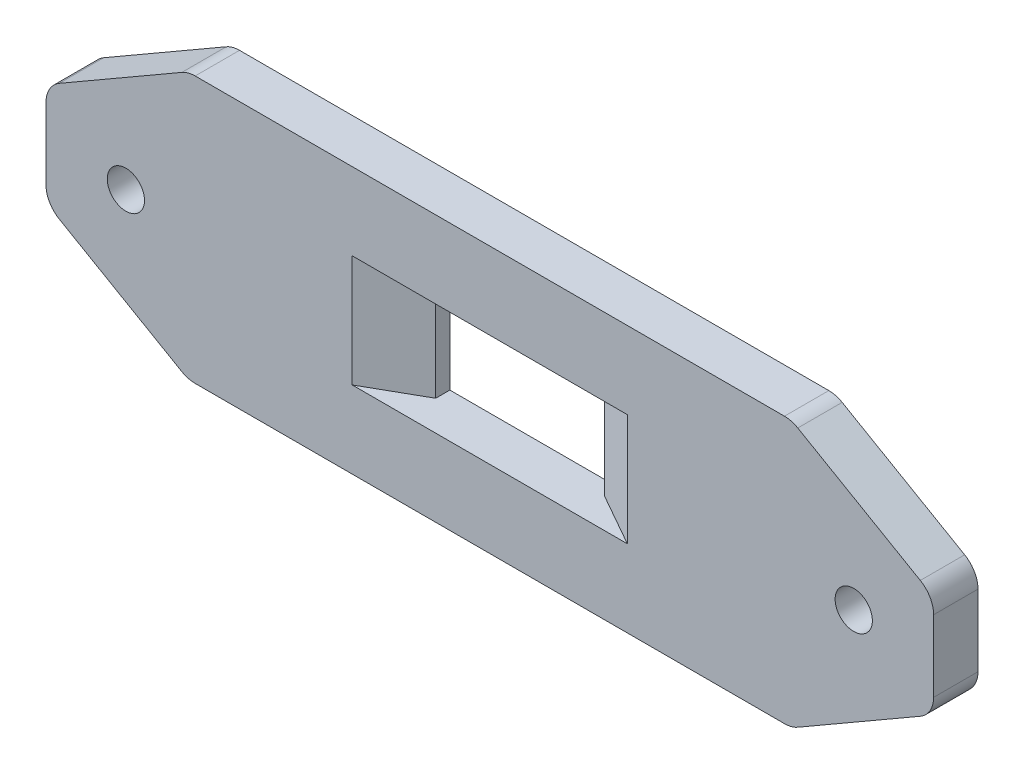
ISO-10303-21;
HEADER;
FILE_DESCRIPTION(('STEP AP214'),'2;1');
FILE_NAME('part.step','',(''),(''),'','','');
FILE_SCHEMA(('AUTOMOTIVE_DESIGN { 1 0 10303 214 1 1 1 1 }'));
ENDSEC;
DATA;
#1=APPLICATION_CONTEXT('core data for automotive mechanical design processes');
#2=APPLICATION_PROTOCOL_DEFINITION('international standard','automotive_design',2000,#1);
#3=PRODUCT_CONTEXT('',#1,'mechanical');
#4=PRODUCT('Part','Part','',(#3));
#5=PRODUCT_RELATED_PRODUCT_CATEGORY('part','',(#4));
#6=PRODUCT_DEFINITION_FORMATION('','',#4);
#7=PRODUCT_DEFINITION_CONTEXT('part definition',#1,'design');
#8=PRODUCT_DEFINITION('design','',#6,#7);
#9=PRODUCT_DEFINITION_SHAPE('','',#8);
#10=(LENGTH_UNIT() NAMED_UNIT(*) SI_UNIT(.MILLI.,.METRE.));
#11=(NAMED_UNIT(*) PLANE_ANGLE_UNIT() SI_UNIT($,.RADIAN.));
#12=(NAMED_UNIT(*) SI_UNIT($,.STERADIAN.) SOLID_ANGLE_UNIT());
#13=UNCERTAINTY_MEASURE_WITH_UNIT(LENGTH_MEASURE(1.E-05),#10,'distance_accuracy_value','');
#14=(GEOMETRIC_REPRESENTATION_CONTEXT(3) GLOBAL_UNCERTAINTY_ASSIGNED_CONTEXT((#13)) GLOBAL_UNIT_ASSIGNED_CONTEXT((#10,
#11,#12)) REPRESENTATION_CONTEXT('',''));
#15=CARTESIAN_POINT('',(0.,0.,0.));
#16=DIRECTION('',(0.,0.,1.));
#17=DIRECTION('',(1.,0.,0.));
#18=AXIS2_PLACEMENT_3D('',#15,#16,#17);
#19=CARTESIAN_POINT('',(0.,0.,5.));
#20=DIRECTION('',(-1.,0.,0.));
#21=DIRECTION('',(0.,0.,1.));
#22=AXIS2_PLACEMENT_3D('',#19,#20,#21);
#23=PLANE('',#22);
#24=DIRECTION('',(0.,1.,0.));
#25=VECTOR('',#24,1.);
#26=CARTESIAN_POINT('',(0.,0.,0.));
#27=LINE('',#26,#25);
#28=CARTESIAN_POINT('',(0.,10.9696551146029,0.));
#29=VERTEX_POINT('',#28);
#30=CARTESIAN_POINT('',(0.,19.0303448853971,0.));
#31=VERTEX_POINT('',#30);
#32=EDGE_CURVE('E228',#29,#31,#27,.T.);
#33=ORIENTED_EDGE('',*,*,#32,.T.);
#34=DIRECTION('',(0.,0.,-1.));
#35=VECTOR('',#34,1.);
#36=CARTESIAN_POINT('',(0.,19.0303448853971,5.));
#37=LINE('',#36,#35);
#38=CARTESIAN_POINT('',(0.,19.0303448853971,5.));
#39=VERTEX_POINT('',#38);
#40=EDGE_CURVE('E343',#31,#39,#37,.F.);
#41=ORIENTED_EDGE('',*,*,#40,.T.);
#42=DIRECTION('',(0.,1.,0.));
#43=VECTOR('',#42,1.);
#44=CARTESIAN_POINT('',(0.,0.,5.));
#45=LINE('',#44,#43);
#46=CARTESIAN_POINT('',(0.,10.9696551146029,5.));
#47=VERTEX_POINT('',#46);
#48=EDGE_CURVE('E231',#47,#39,#45,.T.);
#49=ORIENTED_EDGE('',*,*,#48,.F.);
#50=DIRECTION('',(0.,0.,1.));
#51=VECTOR('',#50,1.);
#52=CARTESIAN_POINT('',(0.,10.9696551146029,0.));
#53=LINE('',#52,#51);
#54=EDGE_CURVE('E340',#47,#29,#53,.F.);
#55=ORIENTED_EDGE('',*,*,#54,.T.);
#56=EDGE_LOOP('',(#33,#41,#49,#55));
#57=FACE_BOUND('',#56,.T.);
#58=ADVANCED_FACE('F33',(#57),#23,.F.);
#59=CARTESIAN_POINT('',(0.,30.,5.));
#60=DIRECTION('',(0.,-1.,0.));
#61=DIRECTION('',(1.,0.,0.));
#62=AXIS2_PLACEMENT_3D('',#59,#60,#61);
#63=PLANE('',#62);
#64=DIRECTION('',(-1.,0.,0.));
#65=VECTOR('',#64,1.);
#66=CARTESIAN_POINT('',(0.,30.,0.));
#67=LINE('',#66,#65);
#68=CARTESIAN_POINT('',(-16.8038475772935,30.,0.));
#69=VERTEX_POINT('',#68);
#70=CARTESIAN_POINT('',(-83.1961524227065,30.,0.));
#71=VERTEX_POINT('',#70);
#72=EDGE_CURVE('E247',#69,#71,#67,.T.);
#73=ORIENTED_EDGE('',*,*,#72,.T.);
#74=DIRECTION('',(0.,0.,-1.));
#75=VECTOR('',#74,1.);
#76=CARTESIAN_POINT('',(-83.1961524227065,30.,5.));
#77=LINE('',#76,#75);
#78=CARTESIAN_POINT('',(-83.1961524227065,30.,5.));
#79=VERTEX_POINT('',#78);
#80=EDGE_CURVE('E333',#71,#79,#77,.F.);
#81=ORIENTED_EDGE('',*,*,#80,.T.);
#82=DIRECTION('',(-1.,0.,0.));
#83=VECTOR('',#82,1.);
#84=CARTESIAN_POINT('',(0.,30.,5.));
#85=LINE('',#84,#83);
#86=CARTESIAN_POINT('',(-16.8038475772935,30.,5.));
#87=VERTEX_POINT('',#86);
#88=EDGE_CURVE('E234',#87,#79,#85,.T.);
#89=ORIENTED_EDGE('',*,*,#88,.F.);
#90=DIRECTION('',(0.,0.,1.));
#91=VECTOR('',#90,1.);
#92=CARTESIAN_POINT('',(-16.8038475772935,30.,0.));
#93=LINE('',#92,#91);
#94=EDGE_CURVE('E330',#87,#69,#93,.F.);
#95=ORIENTED_EDGE('',*,*,#94,.T.);
#96=EDGE_LOOP('',(#73,#81,#89,#95));
#97=FACE_BOUND('',#96,.T.);
#98=ADVANCED_FACE('F385',(#97),#63,.F.);
#99=CARTESIAN_POINT('',(-100.,0.,5.));
#100=DIRECTION('',(1.,0.,0.));
#101=DIRECTION('',(0.,0.,-1.));
#102=AXIS2_PLACEMENT_3D('',#99,#100,#101);
#103=PLANE('',#102);
#104=DIRECTION('',(0.,-1.,0.));
#105=VECTOR('',#104,1.);
#106=CARTESIAN_POINT('',(-100.,0.,5.));
#107=LINE('',#106,#105);
#108=CARTESIAN_POINT('',(-100.,19.0303448853971,5.));
#109=VERTEX_POINT('',#108);
#110=CARTESIAN_POINT('',(-100.,10.9696551146029,5.));
#111=VERTEX_POINT('',#110);
#112=EDGE_CURVE('E238',#109,#111,#107,.T.);
#113=ORIENTED_EDGE('',*,*,#112,.F.);
#114=DIRECTION('',(0.,0.,1.));
#115=VECTOR('',#114,1.);
#116=CARTESIAN_POINT('',(-100.,19.0303448853971,0.));
#117=LINE('',#116,#115);
#118=CARTESIAN_POINT('',(-100.,19.0303448853971,0.));
#119=VERTEX_POINT('',#118);
#120=EDGE_CURVE('E281',#109,#119,#117,.F.);
#121=ORIENTED_EDGE('',*,*,#120,.T.);
#122=DIRECTION('',(0.,-1.,0.));
#123=VECTOR('',#122,1.);
#124=CARTESIAN_POINT('',(-100.,0.,0.));
#125=LINE('',#124,#123);
#126=CARTESIAN_POINT('',(-100.,10.9696551146029,0.));
#127=VERTEX_POINT('',#126);
#128=EDGE_CURVE('E250',#119,#127,#125,.T.);
#129=ORIENTED_EDGE('',*,*,#128,.T.);
#130=DIRECTION('',(0.,0.,-1.));
#131=VECTOR('',#130,1.);
#132=CARTESIAN_POINT('',(-100.,10.9696551146029,5.));
#133=LINE('',#132,#131);
#134=EDGE_CURVE('E278',#127,#111,#133,.F.);
#135=ORIENTED_EDGE('',*,*,#134,.T.);
#136=EDGE_LOOP('',(#113,#121,#129,#135));
#137=FACE_BOUND('',#136,.T.);
#138=ADVANCED_FACE('F391',(#137),#103,.F.);
#139=CARTESIAN_POINT('',(0.,0.,5.));
#140=DIRECTION('',(0.,1.,0.));
#141=DIRECTION('',(-1.,0.,0.));
#142=AXIS2_PLACEMENT_3D('',#139,#140,#141);
#143=PLANE('',#142);
#144=DIRECTION('',(1.,0.,0.));
#145=VECTOR('',#144,1.);
#146=CARTESIAN_POINT('',(0.,0.,5.));
#147=LINE('',#146,#145);
#148=CARTESIAN_POINT('',(-83.1961524227065,0.,5.));
#149=VERTEX_POINT('',#148);
#150=CARTESIAN_POINT('',(-16.8038475772935,0.,5.));
#151=VERTEX_POINT('',#150);
#152=EDGE_CURVE('E241',#149,#151,#147,.T.);
#153=ORIENTED_EDGE('',*,*,#152,.F.);
#154=DIRECTION('',(0.,0.,1.));
#155=VECTOR('',#154,1.);
#156=CARTESIAN_POINT('',(-83.1961524227065,0.,0.));
#157=LINE('',#156,#155);
#158=CARTESIAN_POINT('',(-83.1961524227065,0.,0.));
#159=VERTEX_POINT('',#158);
#160=EDGE_CURVE('E327',#149,#159,#157,.F.);
#161=ORIENTED_EDGE('',*,*,#160,.T.);
#162=DIRECTION('',(1.,0.,0.));
#163=VECTOR('',#162,1.);
#164=CARTESIAN_POINT('',(0.,0.,0.));
#165=LINE('',#164,#163);
#166=CARTESIAN_POINT('',(-16.8038475772935,0.,0.));
#167=VERTEX_POINT('',#166);
#168=EDGE_CURVE('E235',#159,#167,#165,.T.);
#169=ORIENTED_EDGE('',*,*,#168,.T.);
#170=DIRECTION('',(0.,0.,-1.));
#171=VECTOR('',#170,1.);
#172=CARTESIAN_POINT('',(-16.8038475772935,0.,5.));
#173=LINE('',#172,#171);
#174=EDGE_CURVE('E324',#167,#151,#173,.F.);
#175=ORIENTED_EDGE('',*,*,#174,.T.);
#176=EDGE_LOOP('',(#153,#161,#169,#175));
#177=FACE_BOUND('',#176,.T.);
#178=ADVANCED_FACE('F461',(#177),#143,.F.);
#179=CARTESIAN_POINT('',(0.,0.,5.));
#180=DIRECTION('',(0.,0.,1.));
#181=DIRECTION('',(1.,0.,0.));
#182=AXIS2_PLACEMENT_3D('',#179,#180,#181);
#183=PLANE('',#182);
#184=DIRECTION('',(-1.,0.,0.));
#185=VECTOR('',#184,1.);
#186=CARTESIAN_POINT('',(-59.5,21.3,5.));
#187=LINE('',#186,#185);
#188=CARTESIAN_POINT('',(-34.5,21.3,5.));
#189=VERTEX_POINT('',#188);
#190=CARTESIAN_POINT('',(-65.5,21.3,5.));
#191=VERTEX_POINT('',#190);
#192=EDGE_CURVE('E204',#189,#191,#187,.T.);
#193=ORIENTED_EDGE('',*,*,#192,.F.);
#194=DIRECTION('',(0.,-1.,0.));
#195=VECTOR('',#194,1.);
#196=CARTESIAN_POINT('',(-34.5,8.69999999999999,5.));
#197=LINE('',#196,#195);
#198=CARTESIAN_POINT('',(-34.5,8.69999999999999,5.));
#199=VERTEX_POINT('',#198);
#200=EDGE_CURVE('E356',#189,#199,#197,.T.);
#201=ORIENTED_EDGE('',*,*,#200,.T.);
#202=DIRECTION('',(1.,0.,0.));
#203=VECTOR('',#202,1.);
#204=CARTESIAN_POINT('',(-59.5,8.69999999999999,5.));
#205=LINE('',#204,#203);
#206=CARTESIAN_POINT('',(-65.5,8.69999999999999,5.));
#207=VERTEX_POINT('',#206);
#208=EDGE_CURVE('E206',#207,#199,#205,.T.);
#209=ORIENTED_EDGE('',*,*,#208,.F.);
#210=DIRECTION('',(0.,1.,0.));
#211=VECTOR('',#210,1.);
#212=CARTESIAN_POINT('',(-65.5,21.3,5.));
#213=LINE('',#212,#211);
#214=EDGE_CURVE('E353',#207,#191,#213,.T.);
#215=ORIENTED_EDGE('',*,*,#214,.T.);
#216=EDGE_LOOP('',(#193,#201,#209,#215));
#217=FACE_BOUND('',#216,.T.);
#218=CARTESIAN_POINT('',(-9.00000000000001,15.,5.));
#219=DIRECTION('',(0.,0.,1.));
#220=DIRECTION('',(1.,0.,0.));
#221=AXIS2_PLACEMENT_3D('',#218,#219,#220);
#222=CIRCLE('',#221,2.1);
#223=CARTESIAN_POINT('',(-6.90000000000001,15.,5.));
#224=VERTEX_POINT('',#223);
#225=EDGE_CURVE('E214',#224,#224,#222,.T.);
#226=ORIENTED_EDGE('',*,*,#225,.F.);
#227=EDGE_LOOP('',(#226));
#228=FACE_BOUND('',#227,.T.);
#229=CARTESIAN_POINT('',(-91.,15.,5.));
#230=DIRECTION('',(0.,0.,1.));
#231=DIRECTION('',(1.,0.,0.));
#232=AXIS2_PLACEMENT_3D('',#229,#230,#231);
#233=CIRCLE('',#232,2.1);
#234=CARTESIAN_POINT('',(-88.9,15.,5.));
#235=VERTEX_POINT('',#234);
#236=EDGE_CURVE('E222',#235,#235,#233,.T.);
#237=ORIENTED_EDGE('',*,*,#236,.F.);
#238=EDGE_LOOP('',(#237));
#239=FACE_BOUND('',#238,.T.);
#240=DIRECTION('',(0.86602540378444,0.499999999999998,0.));
#241=VECTOR('',#240,1.);
#242=CARTESIAN_POINT('',(-33.9903810567664,58.8730669589464,5.));
#243=LINE('',#242,#241);
#244=CARTESIAN_POINT('',(-84.6961524227065,29.5980762113533,5.));
#245=VERTEX_POINT('',#244);
#246=CARTESIAN_POINT('',(-98.5,21.6284210967504,5.));
#247=VERTEX_POINT('',#246);
#248=EDGE_CURVE('E266',#245,#247,#243,.F.);
#249=ORIENTED_EDGE('',*,*,#248,.T.);
#250=CARTESIAN_POINT('',(-97.,19.0303448853971,5.));
#251=DIRECTION('',(0.,0.,1.));
#252=DIRECTION('',(1.,0.,0.));
#253=AXIS2_PLACEMENT_3D('',#250,#251,#252);
#254=CIRCLE('',#253,3.);
#255=EDGE_CURVE('E318',#247,#109,#254,.T.);
#256=ORIENTED_EDGE('',*,*,#255,.T.);
#257=ORIENTED_EDGE('',*,*,#112,.T.);
#258=CARTESIAN_POINT('',(-97.,10.9696551146029,5.));
#259=DIRECTION('',(0.,0.,1.));
#260=DIRECTION('',(1.,0.,0.));
#261=AXIS2_PLACEMENT_3D('',#258,#259,#260);
#262=CIRCLE('',#261,3.);
#263=CARTESIAN_POINT('',(-98.5,8.37157890324956,5.));
#264=VERTEX_POINT('',#263);
#265=EDGE_CURVE('E316',#111,#264,#262,.T.);
#266=ORIENTED_EDGE('',*,*,#265,.T.);
#267=DIRECTION('',(-0.86602540378444,0.499999999999998,0.));
#268=VECTOR('',#267,1.);
#269=CARTESIAN_POINT('',(-20.9999999999998,-36.3730669589463,5.));
#270=LINE('',#269,#268);
#271=CARTESIAN_POINT('',(-84.6961524227065,0.401923788646674,5.));
#272=VERTEX_POINT('',#271);
#273=EDGE_CURVE('E269',#264,#272,#270,.F.);
#274=ORIENTED_EDGE('',*,*,#273,.T.);
#275=CARTESIAN_POINT('',(-83.1961524227065,2.99999999999999,5.));
#276=DIRECTION('',(0.,0.,1.));
#277=DIRECTION('',(1.,0.,0.));
#278=AXIS2_PLACEMENT_3D('',#275,#276,#277);
#279=CIRCLE('',#278,3.);
#280=EDGE_CURVE('E314',#272,#149,#279,.T.);
#281=ORIENTED_EDGE('',*,*,#280,.T.);
#282=ORIENTED_EDGE('',*,*,#152,.T.);
#283=CARTESIAN_POINT('',(-16.8038475772935,3.,5.));
#284=DIRECTION('',(0.,0.,1.));
#285=DIRECTION('',(1.,0.,0.));
#286=AXIS2_PLACEMENT_3D('',#283,#284,#285);
#287=CIRCLE('',#286,3.);
#288=CARTESIAN_POINT('',(-15.3038475772935,0.401923788646678,5.));
#289=VERTEX_POINT('',#288);
#290=EDGE_CURVE('E304',#151,#289,#287,.T.);
#291=ORIENTED_EDGE('',*,*,#290,.T.);
#292=DIRECTION('',(-0.86602540378444,-0.499999999999998,0.));
#293=VECTOR('',#292,1.);
#294=CARTESIAN_POINT('',(-3.99999999999999,6.92820323027553,5.));
#295=LINE('',#294,#293);
#296=CARTESIAN_POINT('',(-1.50000000000001,8.37157890324958,5.));
#297=VERTEX_POINT('',#296);
#298=EDGE_CURVE('E272',#289,#297,#295,.F.);
#299=ORIENTED_EDGE('',*,*,#298,.T.);
#300=CARTESIAN_POINT('',(-3.,10.9696551146029,5.));
#301=DIRECTION('',(0.,0.,1.));
#302=DIRECTION('',(1.,0.,0.));
#303=AXIS2_PLACEMENT_3D('',#300,#301,#302);
#304=CIRCLE('',#303,3.);
#305=EDGE_CURVE('E306',#297,#47,#304,.T.);
#306=ORIENTED_EDGE('',*,*,#305,.T.);
#307=ORIENTED_EDGE('',*,*,#48,.T.);
#308=CARTESIAN_POINT('',(-3.,19.0303448853971,5.));
#309=DIRECTION('',(0.,0.,1.));
#310=DIRECTION('',(1.,0.,0.));
#311=AXIS2_PLACEMENT_3D('',#308,#309,#310);
#312=CIRCLE('',#311,3.);
#313=CARTESIAN_POINT('',(-1.50000000000001,21.6284210967504,5.));
#314=VERTEX_POINT('',#313);
#315=EDGE_CURVE('E308',#39,#314,#312,.T.);
#316=ORIENTED_EDGE('',*,*,#315,.T.);
#317=DIRECTION('',(0.86602540378444,-0.499999999999998,0.));
#318=VECTOR('',#317,1.);
#319=CARTESIAN_POINT('',(8.99038105676655,15.5717967697245,5.));
#320=LINE('',#319,#318);
#321=CARTESIAN_POINT('',(-15.3038475772935,29.5980762113533,5.));
#322=VERTEX_POINT('',#321);
#323=EDGE_CURVE('E275',#314,#322,#320,.F.);
#324=ORIENTED_EDGE('',*,*,#323,.T.);
#325=CARTESIAN_POINT('',(-16.8038475772935,27.,5.));
#326=DIRECTION('',(0.,0.,1.));
#327=DIRECTION('',(1.,0.,0.));
#328=AXIS2_PLACEMENT_3D('',#325,#326,#327);
#329=CIRCLE('',#328,3.);
#330=EDGE_CURVE('E310',#322,#87,#329,.T.);
#331=ORIENTED_EDGE('',*,*,#330,.T.);
#332=ORIENTED_EDGE('',*,*,#88,.T.);
#333=CARTESIAN_POINT('',(-83.1961524227065,27.,5.));
#334=DIRECTION('',(0.,0.,1.));
#335=DIRECTION('',(1.,0.,0.));
#336=AXIS2_PLACEMENT_3D('',#333,#334,#335);
#337=CIRCLE('',#336,3.);
#338=EDGE_CURVE('E312',#79,#245,#337,.T.);
#339=ORIENTED_EDGE('',*,*,#338,.T.);
#340=EDGE_LOOP('',(#249,#256,#257,#266,#274,#281,#282,#291,#299,#306,#307,#316,#324,#331,#332,#339));
#341=FACE_BOUND('',#340,.T.);
#342=ADVANCED_FACE('F365',(#217,#228,#239,#341),#183,.T.);
#343=CARTESIAN_POINT('',(0.,0.,0.));
#344=DIRECTION('',(0.,0.,1.));
#345=DIRECTION('',(1.,0.,0.));
#346=AXIS2_PLACEMENT_3D('',#343,#344,#345);
#347=PLANE('',#346);
#348=DIRECTION('',(-1.,0.,0.));
#349=VECTOR('',#348,1.);
#350=CARTESIAN_POINT('',(-59.5,21.3,0.));
#351=LINE('',#350,#349);
#352=CARTESIAN_POINT('',(-40.5,21.3,0.));
#353=VERTEX_POINT('',#352);
#354=CARTESIAN_POINT('',(-59.5,21.3,0.));
#355=VERTEX_POINT('',#354);
#356=EDGE_CURVE('E190',#353,#355,#351,.T.);
#357=ORIENTED_EDGE('',*,*,#356,.T.);
#358=DIRECTION('',(0.,-1.,0.));
#359=VECTOR('',#358,1.);
#360=CARTESIAN_POINT('',(-59.5,8.69999999999999,0.));
#361=LINE('',#360,#359);
#362=CARTESIAN_POINT('',(-59.5,8.69999999999999,0.));
#363=VERTEX_POINT('',#362);
#364=EDGE_CURVE('E185',#355,#363,#361,.T.);
#365=ORIENTED_EDGE('',*,*,#364,.T.);
#366=DIRECTION('',(1.,0.,0.));
#367=VECTOR('',#366,1.);
#368=CARTESIAN_POINT('',(-59.5,8.69999999999999,0.));
#369=LINE('',#368,#367);
#370=CARTESIAN_POINT('',(-40.5,8.69999999999999,0.));
#371=VERTEX_POINT('',#370);
#372=EDGE_CURVE('E194',#363,#371,#369,.T.);
#373=ORIENTED_EDGE('',*,*,#372,.T.);
#374=DIRECTION('',(0.,1.,0.));
#375=VECTOR('',#374,1.);
#376=CARTESIAN_POINT('',(-40.5,8.69999999999999,0.));
#377=LINE('',#376,#375);
#378=EDGE_CURVE('E199',#371,#353,#377,.T.);
#379=ORIENTED_EDGE('',*,*,#378,.T.);
#380=EDGE_LOOP('',(#357,#365,#373,#379));
#381=FACE_BOUND('',#380,.T.);
#382=CARTESIAN_POINT('',(-9.00000000000001,15.,0.));
#383=DIRECTION('',(0.,0.,1.));
#384=DIRECTION('',(1.,0.,0.));
#385=AXIS2_PLACEMENT_3D('',#382,#383,#384);
#386=CIRCLE('',#385,2.1);
#387=CARTESIAN_POINT('',(-6.90000000000001,15.,0.));
#388=VERTEX_POINT('',#387);
#389=EDGE_CURVE('E219',#388,#388,#386,.T.);
#390=ORIENTED_EDGE('',*,*,#389,.T.);
#391=EDGE_LOOP('',(#390));
#392=FACE_BOUND('',#391,.T.);
#393=CARTESIAN_POINT('',(-91.,15.,0.));
#394=DIRECTION('',(0.,0.,1.));
#395=DIRECTION('',(1.,0.,0.));
#396=AXIS2_PLACEMENT_3D('',#393,#394,#395);
#397=CIRCLE('',#396,2.1);
#398=CARTESIAN_POINT('',(-88.9,15.,0.));
#399=VERTEX_POINT('',#398);
#400=EDGE_CURVE('E225',#399,#399,#397,.T.);
#401=ORIENTED_EDGE('',*,*,#400,.T.);
#402=EDGE_LOOP('',(#401));
#403=FACE_BOUND('',#402,.T.);
#404=ORIENTED_EDGE('',*,*,#128,.F.);
#405=CARTESIAN_POINT('',(-97.,19.0303448853971,0.));
#406=DIRECTION('',(0.,0.,1.));
#407=DIRECTION('',(1.,0.,0.));
#408=AXIS2_PLACEMENT_3D('',#405,#406,#407);
#409=CIRCLE('',#408,3.);
#410=CARTESIAN_POINT('',(-98.5,21.6284210967504,0.));
#411=VERTEX_POINT('',#410);
#412=EDGE_CURVE('E298',#119,#411,#409,.F.);
#413=ORIENTED_EDGE('',*,*,#412,.T.);
#414=DIRECTION('',(-0.86602540378444,-0.499999999999998,0.));
#415=VECTOR('',#414,1.);
#416=CARTESIAN_POINT('',(-100.,20.762395692966,0.));
#417=LINE('',#416,#415);
#418=CARTESIAN_POINT('',(-84.6961524227065,29.5980762113533,0.));
#419=VERTEX_POINT('',#418);
#420=EDGE_CURVE('E244',#411,#419,#417,.F.);
#421=ORIENTED_EDGE('',*,*,#420,.T.);
#422=CARTESIAN_POINT('',(-83.1961524227065,27.,0.));
#423=DIRECTION('',(0.,0.,1.));
#424=DIRECTION('',(1.,0.,0.));
#425=AXIS2_PLACEMENT_3D('',#422,#423,#424);
#426=CIRCLE('',#425,3.);
#427=EDGE_CURVE('E292',#419,#71,#426,.F.);
#428=ORIENTED_EDGE('',*,*,#427,.T.);
#429=ORIENTED_EDGE('',*,*,#72,.F.);
#430=CARTESIAN_POINT('',(-16.8038475772935,27.,0.));
#431=DIRECTION('',(0.,0.,1.));
#432=DIRECTION('',(1.,0.,0.));
#433=AXIS2_PLACEMENT_3D('',#430,#431,#432);
#434=CIRCLE('',#433,3.);
#435=CARTESIAN_POINT('',(-15.3038475772935,29.5980762113533,0.));
#436=VERTEX_POINT('',#435);
#437=EDGE_CURVE('E290',#69,#436,#434,.F.);
#438=ORIENTED_EDGE('',*,*,#437,.T.);
#439=DIRECTION('',(-0.86602540378444,0.499999999999998,0.));
#440=VECTOR('',#439,1.);
#441=CARTESIAN_POINT('',(-16.0000000000001,30.,0.));
#442=LINE('',#441,#440);
#443=CARTESIAN_POINT('',(-1.5,21.6284210967504,0.));
#444=VERTEX_POINT('',#443);
#445=EDGE_CURVE('E263',#436,#444,#442,.F.);
#446=ORIENTED_EDGE('',*,*,#445,.T.);
#447=CARTESIAN_POINT('',(-3.,19.0303448853971,0.));
#448=DIRECTION('',(0.,0.,1.));
#449=DIRECTION('',(1.,0.,0.));
#450=AXIS2_PLACEMENT_3D('',#447,#448,#449);
#451=CIRCLE('',#450,3.);
#452=EDGE_CURVE('E288',#444,#31,#451,.F.);
#453=ORIENTED_EDGE('',*,*,#452,.T.);
#454=ORIENTED_EDGE('',*,*,#32,.F.);
#455=CARTESIAN_POINT('',(-3.,10.9696551146029,0.));
#456=DIRECTION('',(0.,0.,1.));
#457=DIRECTION('',(1.,0.,0.));
#458=AXIS2_PLACEMENT_3D('',#455,#456,#457);
#459=CIRCLE('',#458,3.);
#460=CARTESIAN_POINT('',(-1.5,8.37157890324958,0.));
#461=VERTEX_POINT('',#460);
#462=EDGE_CURVE('E286',#29,#461,#459,.F.);
#463=ORIENTED_EDGE('',*,*,#462,.T.);
#464=DIRECTION('',(0.86602540378444,0.499999999999998,0.));
#465=VECTOR('',#464,1.);
#466=CARTESIAN_POINT('',(0.,9.23760430703402,0.));
#467=LINE('',#466,#465);
#468=CARTESIAN_POINT('',(-15.3038475772935,0.401923788646678,0.));
#469=VERTEX_POINT('',#468);
#470=EDGE_CURVE('E260',#461,#469,#467,.F.);
#471=ORIENTED_EDGE('',*,*,#470,.T.);
#472=CARTESIAN_POINT('',(-16.8038475772935,3.,0.));
#473=DIRECTION('',(0.,0.,1.));
#474=DIRECTION('',(1.,0.,0.));
#475=AXIS2_PLACEMENT_3D('',#472,#473,#474);
#476=CIRCLE('',#475,3.);
#477=EDGE_CURVE('E284',#469,#167,#476,.F.);
#478=ORIENTED_EDGE('',*,*,#477,.T.);
#479=ORIENTED_EDGE('',*,*,#168,.F.);
#480=CARTESIAN_POINT('',(-83.1961524227065,2.99999999999999,0.));
#481=DIRECTION('',(0.,0.,1.));
#482=DIRECTION('',(1.,0.,0.));
#483=AXIS2_PLACEMENT_3D('',#480,#481,#482);
#484=CIRCLE('',#483,3.);
#485=CARTESIAN_POINT('',(-84.6961524227065,0.401923788646672,0.));
#486=VERTEX_POINT('',#485);
#487=EDGE_CURVE('E294',#159,#486,#484,.F.);
#488=ORIENTED_EDGE('',*,*,#487,.T.);
#489=DIRECTION('',(0.86602540378444,-0.499999999999998,0.));
#490=VECTOR('',#489,1.);
#491=CARTESIAN_POINT('',(-83.9999999999999,0.,0.));
#492=LINE('',#491,#490);
#493=CARTESIAN_POINT('',(-98.5,8.37157890324957,0.));
#494=VERTEX_POINT('',#493);
#495=EDGE_CURVE('E257',#486,#494,#492,.F.);
#496=ORIENTED_EDGE('',*,*,#495,.T.);
#497=CARTESIAN_POINT('',(-97.,10.9696551146029,0.));
#498=DIRECTION('',(0.,0.,1.));
#499=DIRECTION('',(1.,0.,0.));
#500=AXIS2_PLACEMENT_3D('',#497,#498,#499);
#501=CIRCLE('',#500,3.);
#502=EDGE_CURVE('E296',#494,#127,#501,.F.);
#503=ORIENTED_EDGE('',*,*,#502,.T.);
#504=EDGE_LOOP('',(#404,#413,#421,#428,#429,#438,#446,#453,#454,#463,#471,#478,#479,#488,#496,#503));
#505=FACE_BOUND('',#504,.T.);
#506=ADVANCED_FACE('F201',(#381,#392,#403,#505),#347,.F.);
#507=CARTESIAN_POINT('',(-16.0000000000001,30.,5.));
#508=DIRECTION('',(-0.499999999999998,-0.86602540378444,0.));
#509=DIRECTION('',(0.,0.,-1.));
#510=AXIS2_PLACEMENT_3D('',#507,#508,#509);
#511=PLANE('',#510);
#512=ORIENTED_EDGE('',*,*,#445,.F.);
#513=DIRECTION('',(0.,0.,-1.));
#514=VECTOR('',#513,1.);
#515=CARTESIAN_POINT('',(-15.3038475772935,29.5980762113533,5.));
#516=LINE('',#515,#514);
#517=EDGE_CURVE('E338',#436,#322,#516,.F.);
#518=ORIENTED_EDGE('',*,*,#517,.T.);
#519=ORIENTED_EDGE('',*,*,#323,.F.);
#520=DIRECTION('',(0.,0.,1.));
#521=VECTOR('',#520,1.);
#522=CARTESIAN_POINT('',(-1.50000000000001,21.6284210967504,0.));
#523=LINE('',#522,#521);
#524=EDGE_CURVE('E336',#314,#444,#523,.F.);
#525=ORIENTED_EDGE('',*,*,#524,.T.);
#526=EDGE_LOOP('',(#512,#518,#519,#525));
#527=FACE_BOUND('',#526,.T.);
#528=ADVANCED_FACE('F396',(#527),#511,.F.);
#529=CARTESIAN_POINT('',(0.,9.23760430703402,5.));
#530=DIRECTION('',(-0.499999999999998,0.86602540378444,0.));
#531=DIRECTION('',(0.,0.,-1.));
#532=AXIS2_PLACEMENT_3D('',#529,#530,#531);
#533=PLANE('',#532);
#534=ORIENTED_EDGE('',*,*,#470,.F.);
#535=DIRECTION('',(0.,0.,-1.));
#536=VECTOR('',#535,1.);
#537=CARTESIAN_POINT('',(-1.5,8.37157890324958,5.));
#538=LINE('',#537,#536);
#539=EDGE_CURVE('E348',#461,#297,#538,.F.);
#540=ORIENTED_EDGE('',*,*,#539,.T.);
#541=ORIENTED_EDGE('',*,*,#298,.F.);
#542=DIRECTION('',(0.,0.,1.));
#543=VECTOR('',#542,1.);
#544=CARTESIAN_POINT('',(-15.3038475772935,0.401923788646678,0.));
#545=LINE('',#544,#543);
#546=EDGE_CURVE('E346',#289,#469,#545,.F.);
#547=ORIENTED_EDGE('',*,*,#546,.T.);
#548=EDGE_LOOP('',(#534,#540,#541,#547));
#549=FACE_BOUND('',#548,.T.);
#550=ADVANCED_FACE('F399',(#549),#533,.F.);
#551=CARTESIAN_POINT('',(-83.9999999999999,0.,5.));
#552=DIRECTION('',(0.499999999999998,0.86602540378444,0.));
#553=DIRECTION('',(0.,0.,-1.));
#554=AXIS2_PLACEMENT_3D('',#551,#552,#553);
#555=PLANE('',#554);
#556=ORIENTED_EDGE('',*,*,#273,.F.);
#557=DIRECTION('',(0.,0.,1.));
#558=VECTOR('',#557,1.);
#559=CARTESIAN_POINT('',(-98.5,8.37157890324957,0.));
#560=LINE('',#559,#558);
#561=EDGE_CURVE('E322',#264,#494,#560,.F.);
#562=ORIENTED_EDGE('',*,*,#561,.T.);
#563=ORIENTED_EDGE('',*,*,#495,.F.);
#564=DIRECTION('',(0.,0.,-1.));
#565=VECTOR('',#564,1.);
#566=CARTESIAN_POINT('',(-84.6961524227065,0.401923788646672,5.));
#567=LINE('',#566,#565);
#568=EDGE_CURVE('E320',#486,#272,#567,.F.);
#569=ORIENTED_EDGE('',*,*,#568,.T.);
#570=EDGE_LOOP('',(#556,#562,#563,#569));
#571=FACE_BOUND('',#570,.T.);
#572=ADVANCED_FACE('F403',(#571),#555,.F.);
#573=CARTESIAN_POINT('',(-100.,20.762395692966,5.));
#574=DIRECTION('',(0.499999999999998,-0.86602540378444,0.));
#575=DIRECTION('',(0.,0.,-1.));
#576=AXIS2_PLACEMENT_3D('',#573,#574,#575);
#577=PLANE('',#576);
#578=ORIENTED_EDGE('',*,*,#420,.F.);
#579=DIRECTION('',(0.,0.,-1.));
#580=VECTOR('',#579,1.);
#581=CARTESIAN_POINT('',(-98.5,21.6284210967504,5.));
#582=LINE('',#581,#580);
#583=EDGE_CURVE('E302',#411,#247,#582,.F.);
#584=ORIENTED_EDGE('',*,*,#583,.T.);
#585=ORIENTED_EDGE('',*,*,#248,.F.);
#586=DIRECTION('',(0.,0.,1.));
#587=VECTOR('',#586,1.);
#588=CARTESIAN_POINT('',(-84.6961524227065,29.5980762113533,0.));
#589=LINE('',#588,#587);
#590=EDGE_CURVE('E300',#245,#419,#589,.F.);
#591=ORIENTED_EDGE('',*,*,#590,.T.);
#592=EDGE_LOOP('',(#578,#584,#585,#591));
#593=FACE_BOUND('',#592,.T.);
#594=ADVANCED_FACE('F407',(#593),#577,.F.);
#595=CARTESIAN_POINT('',(-97.,19.0303448853971,5.));
#596=DIRECTION('',(0.,0.,-1.));
#597=DIRECTION('',(-1.,0.,0.));
#598=AXIS2_PLACEMENT_3D('',#595,#596,#597);
#599=CYLINDRICAL_SURFACE('',#598,3.);
#600=ORIENTED_EDGE('',*,*,#255,.F.);
#601=ORIENTED_EDGE('',*,*,#583,.F.);
#602=ORIENTED_EDGE('',*,*,#412,.F.);
#603=ORIENTED_EDGE('',*,*,#120,.F.);
#604=EDGE_LOOP('',(#600,#601,#602,#603));
#605=FACE_BOUND('',#604,.T.);
#606=ADVANCED_FACE('F411',(#605),#599,.T.);
#607=CARTESIAN_POINT('',(-97.,10.9696551146029,5.));
#608=DIRECTION('',(0.,0.,1.));
#609=DIRECTION('',(1.,0.,0.));
#610=AXIS2_PLACEMENT_3D('',#607,#608,#609);
#611=CYLINDRICAL_SURFACE('',#610,3.);
#612=ORIENTED_EDGE('',*,*,#502,.F.);
#613=ORIENTED_EDGE('',*,*,#561,.F.);
#614=ORIENTED_EDGE('',*,*,#265,.F.);
#615=ORIENTED_EDGE('',*,*,#134,.F.);
#616=EDGE_LOOP('',(#612,#613,#614,#615));
#617=FACE_BOUND('',#616,.T.);
#618=ADVANCED_FACE('F415',(#617),#611,.T.);
#619=CARTESIAN_POINT('',(-83.1961524227065,2.99999999999999,5.));
#620=DIRECTION('',(0.,0.,-1.));
#621=DIRECTION('',(-1.,0.,0.));
#622=AXIS2_PLACEMENT_3D('',#619,#620,#621);
#623=CYLINDRICAL_SURFACE('',#622,3.);
#624=ORIENTED_EDGE('',*,*,#280,.F.);
#625=ORIENTED_EDGE('',*,*,#568,.F.);
#626=ORIENTED_EDGE('',*,*,#487,.F.);
#627=ORIENTED_EDGE('',*,*,#160,.F.);
#628=EDGE_LOOP('',(#624,#625,#626,#627));
#629=FACE_BOUND('',#628,.T.);
#630=ADVANCED_FACE('F419',(#629),#623,.T.);
#631=CARTESIAN_POINT('',(-83.1961524227065,27.,5.));
#632=DIRECTION('',(0.,0.,1.));
#633=DIRECTION('',(1.,0.,0.));
#634=AXIS2_PLACEMENT_3D('',#631,#632,#633);
#635=CYLINDRICAL_SURFACE('',#634,3.);
#636=ORIENTED_EDGE('',*,*,#427,.F.);
#637=ORIENTED_EDGE('',*,*,#590,.F.);
#638=ORIENTED_EDGE('',*,*,#338,.F.);
#639=ORIENTED_EDGE('',*,*,#80,.F.);
#640=EDGE_LOOP('',(#636,#637,#638,#639));
#641=FACE_BOUND('',#640,.T.);
#642=ADVANCED_FACE('F423',(#641),#635,.T.);
#643=CARTESIAN_POINT('',(-16.8038475772935,27.,5.));
#644=DIRECTION('',(0.,0.,-1.));
#645=DIRECTION('',(-1.,0.,0.));
#646=AXIS2_PLACEMENT_3D('',#643,#644,#645);
#647=CYLINDRICAL_SURFACE('',#646,3.);
#648=ORIENTED_EDGE('',*,*,#330,.F.);
#649=ORIENTED_EDGE('',*,*,#517,.F.);
#650=ORIENTED_EDGE('',*,*,#437,.F.);
#651=ORIENTED_EDGE('',*,*,#94,.F.);
#652=EDGE_LOOP('',(#648,#649,#650,#651));
#653=FACE_BOUND('',#652,.T.);
#654=ADVANCED_FACE('F427',(#653),#647,.T.);
#655=CARTESIAN_POINT('',(-3.,19.0303448853971,5.));
#656=DIRECTION('',(0.,0.,1.));
#657=DIRECTION('',(1.,0.,0.));
#658=AXIS2_PLACEMENT_3D('',#655,#656,#657);
#659=CYLINDRICAL_SURFACE('',#658,3.);
#660=ORIENTED_EDGE('',*,*,#452,.F.);
#661=ORIENTED_EDGE('',*,*,#524,.F.);
#662=ORIENTED_EDGE('',*,*,#315,.F.);
#663=ORIENTED_EDGE('',*,*,#40,.F.);
#664=EDGE_LOOP('',(#660,#661,#662,#663));
#665=FACE_BOUND('',#664,.T.);
#666=ADVANCED_FACE('F431',(#665),#659,.T.);
#667=CARTESIAN_POINT('',(-3.,10.9696551146029,5.));
#668=DIRECTION('',(0.,0.,-1.));
#669=DIRECTION('',(-1.,0.,0.));
#670=AXIS2_PLACEMENT_3D('',#667,#668,#669);
#671=CYLINDRICAL_SURFACE('',#670,3.);
#672=ORIENTED_EDGE('',*,*,#305,.F.);
#673=ORIENTED_EDGE('',*,*,#539,.F.);
#674=ORIENTED_EDGE('',*,*,#462,.F.);
#675=ORIENTED_EDGE('',*,*,#54,.F.);
#676=EDGE_LOOP('',(#672,#673,#674,#675));
#677=FACE_BOUND('',#676,.T.);
#678=ADVANCED_FACE('F435',(#677),#671,.T.);
#679=CARTESIAN_POINT('',(-16.8038475772935,3.,5.));
#680=DIRECTION('',(0.,0.,1.));
#681=DIRECTION('',(1.,0.,0.));
#682=AXIS2_PLACEMENT_3D('',#679,#680,#681);
#683=CYLINDRICAL_SURFACE('',#682,3.);
#684=ORIENTED_EDGE('',*,*,#477,.F.);
#685=ORIENTED_EDGE('',*,*,#546,.F.);
#686=ORIENTED_EDGE('',*,*,#290,.F.);
#687=ORIENTED_EDGE('',*,*,#174,.F.);
#688=EDGE_LOOP('',(#684,#685,#686,#687));
#689=FACE_BOUND('',#688,.T.);
#690=ADVANCED_FACE('F439',(#689),#683,.T.);
#691=CARTESIAN_POINT('',(-91.,15.,0.));
#692=DIRECTION('',(0.,0.,1.));
#693=DIRECTION('',(1.,0.,0.));
#694=AXIS2_PLACEMENT_3D('',#691,#692,#693);
#695=CYLINDRICAL_SURFACE('',#694,2.1);
#696=ORIENTED_EDGE('',*,*,#400,.F.);
#697=EDGE_LOOP('',(#696));
#698=FACE_BOUND('',#697,.T.);
#699=ORIENTED_EDGE('',*,*,#236,.T.);
#700=EDGE_LOOP('',(#699));
#701=FACE_BOUND('',#700,.T.);
#702=ADVANCED_FACE('F442',(#698,#701),#695,.F.);
#703=CARTESIAN_POINT('',(-9.00000000000001,15.,0.));
#704=DIRECTION('',(0.,0.,1.));
#705=DIRECTION('',(1.,0.,0.));
#706=AXIS2_PLACEMENT_3D('',#703,#704,#705);
#707=CYLINDRICAL_SURFACE('',#706,2.1);
#708=ORIENTED_EDGE('',*,*,#389,.F.);
#709=EDGE_LOOP('',(#708));
#710=FACE_BOUND('',#709,.T.);
#711=ORIENTED_EDGE('',*,*,#225,.T.);
#712=EDGE_LOOP('',(#711));
#713=FACE_BOUND('',#712,.T.);
#714=ADVANCED_FACE('F382',(#710,#713),#707,.F.);
#715=CARTESIAN_POINT('',(-59.5,8.69999999999999,0.));
#716=DIRECTION('',(-1.,0.,0.));
#717=DIRECTION('',(0.,0.,1.));
#718=AXIS2_PLACEMENT_3D('',#715,#716,#717);
#719=PLANE('',#718);
#720=DIRECTION('',(0.,0.,1.));
#721=VECTOR('',#720,1.);
#722=CARTESIAN_POINT('',(-59.5,21.3,0.));
#723=LINE('',#722,#721);
#724=CARTESIAN_POINT('',(-59.5,21.3,1.59999999999999));
#725=VERTEX_POINT('',#724);
#726=EDGE_CURVE('E212',#355,#725,#723,.T.);
#727=ORIENTED_EDGE('',*,*,#726,.T.);
#728=DIRECTION('',(0.,-1.,0.));
#729=VECTOR('',#728,1.);
#730=CARTESIAN_POINT('',(-59.5,8.69999999999999,1.59999999999999));
#731=LINE('',#730,#729);
#732=CARTESIAN_POINT('',(-59.5,8.69999999999999,1.59999999999999));
#733=VERTEX_POINT('',#732);
#734=EDGE_CURVE('E187',#725,#733,#731,.T.);
#735=ORIENTED_EDGE('',*,*,#734,.T.);
#736=DIRECTION('',(0.,0.,1.));
#737=VECTOR('',#736,1.);
#738=CARTESIAN_POINT('',(-59.5,8.69999999999999,0.));
#739=LINE('',#738,#737);
#740=EDGE_CURVE('E181',#363,#733,#739,.T.);
#741=ORIENTED_EDGE('',*,*,#740,.F.);
#742=ORIENTED_EDGE('',*,*,#364,.F.);
#743=EDGE_LOOP('',(#727,#735,#741,#742));
#744=FACE_BOUND('',#743,.T.);
#745=ADVANCED_FACE('F183',(#744),#719,.F.);
#746=CARTESIAN_POINT('',(-59.5,21.3,0.));
#747=DIRECTION('',(0.,1.,0.));
#748=DIRECTION('',(0.,0.,1.));
#749=AXIS2_PLACEMENT_3D('',#746,#747,#748);
#750=PLANE('',#749);
#751=ORIENTED_EDGE('',*,*,#192,.T.);
#752=DIRECTION('',(0.870022185848613,0.,-0.493012571980879));
#753=VECTOR('',#752,1.);
#754=CARTESIAN_POINT('',(-58.813708999159,21.3,1.21110176619007));
#755=LINE('',#754,#753);
#756=EDGE_CURVE('E11',#191,#725,#755,.T.);
#757=ORIENTED_EDGE('',*,*,#756,.T.);
#758=ORIENTED_EDGE('',*,*,#726,.F.);
#759=ORIENTED_EDGE('',*,*,#356,.F.);
#760=DIRECTION('',(0.,0.,1.));
#761=VECTOR('',#760,1.);
#762=CARTESIAN_POINT('',(-40.5,21.3,0.));
#763=LINE('',#762,#761);
#764=CARTESIAN_POINT('',(-40.5,21.3,1.59999999999999));
#765=VERTEX_POINT('',#764);
#766=EDGE_CURVE('E215',#353,#765,#763,.T.);
#767=ORIENTED_EDGE('',*,*,#766,.T.);
#768=DIRECTION('',(0.870022185848613,0.,0.493012571980879));
#769=VECTOR('',#768,1.);
#770=CARTESIAN_POINT('',(-55.5681244743482,21.3,-6.9386038687973));
#771=LINE('',#770,#769);
#772=EDGE_CURVE('E360',#765,#189,#771,.T.);
#773=ORIENTED_EDGE('',*,*,#772,.T.);
#774=EDGE_LOOP('',(#751,#757,#758,#759,#767,#773));
#775=FACE_BOUND('',#774,.T.);
#776=ADVANCED_FACE('F374',(#775),#750,.F.);
#777=CARTESIAN_POINT('',(-40.5,8.69999999999999,0.));
#778=DIRECTION('',(1.,0.,0.));
#779=DIRECTION('',(0.,0.,-1.));
#780=AXIS2_PLACEMENT_3D('',#777,#778,#779);
#781=PLANE('',#780);
#782=DIRECTION('',(0.,0.,1.));
#783=VECTOR('',#782,1.);
#784=CARTESIAN_POINT('',(-40.5,8.69999999999999,0.));
#785=LINE('',#784,#783);
#786=CARTESIAN_POINT('',(-40.5,8.69999999999999,1.59999999999999));
#787=VERTEX_POINT('',#786);
#788=EDGE_CURVE('E189',#371,#787,#785,.T.);
#789=ORIENTED_EDGE('',*,*,#788,.T.);
#790=DIRECTION('',(0.,1.,0.));
#791=VECTOR('',#790,1.);
#792=CARTESIAN_POINT('',(-40.5,21.3,1.59999999999999));
#793=LINE('',#792,#791);
#794=EDGE_CURVE('E350',#787,#765,#793,.T.);
#795=ORIENTED_EDGE('',*,*,#794,.T.);
#796=ORIENTED_EDGE('',*,*,#766,.F.);
#797=ORIENTED_EDGE('',*,*,#378,.F.);
#798=EDGE_LOOP('',(#789,#795,#796,#797));
#799=FACE_BOUND('',#798,.T.);
#800=ADVANCED_FACE('F373',(#799),#781,.F.);
#801=CARTESIAN_POINT('',(-59.5,8.69999999999999,0.));
#802=DIRECTION('',(0.,-1.,0.));
#803=DIRECTION('',(0.,0.,-1.));
#804=AXIS2_PLACEMENT_3D('',#801,#802,#803);
#805=PLANE('',#804);
#806=ORIENTED_EDGE('',*,*,#208,.T.);
#807=DIRECTION('',(-0.870022185848613,0.,-0.493012571980879));
#808=VECTOR('',#807,1.);
#809=CARTESIAN_POINT('',(-55.5681244743482,8.69999999999999,-6.9386038687973));
#810=LINE('',#809,#808);
#811=EDGE_CURVE('E363',#199,#787,#810,.T.);
#812=ORIENTED_EDGE('',*,*,#811,.T.);
#813=ORIENTED_EDGE('',*,*,#788,.F.);
#814=ORIENTED_EDGE('',*,*,#372,.F.);
#815=ORIENTED_EDGE('',*,*,#740,.T.);
#816=DIRECTION('',(-0.870022185848613,0.,0.493012571980879));
#817=VECTOR('',#816,1.);
#818=CARTESIAN_POINT('',(-58.813708999159,8.69999999999999,1.21110176619007));
#819=LINE('',#818,#817);
#820=EDGE_CURVE('E41',#733,#207,#819,.T.);
#821=ORIENTED_EDGE('',*,*,#820,.T.);
#822=EDGE_LOOP('',(#806,#812,#813,#814,#815,#821));
#823=FACE_BOUND('',#822,.T.);
#824=ADVANCED_FACE('F195',(#823),#805,.F.);
#825=CARTESIAN_POINT('',(-40.5,8.69999999999999,1.59999999999999));
#826=DIRECTION('',(-0.493012571980879,0.,0.870022185848613));
#827=DIRECTION('',(0.,-1.,0.));
#828=AXIS2_PLACEMENT_3D('',#825,#826,#827);
#829=PLANE('',#828);
#830=ORIENTED_EDGE('',*,*,#811,.F.);
#831=ORIENTED_EDGE('',*,*,#200,.F.);
#832=ORIENTED_EDGE('',*,*,#772,.F.);
#833=ORIENTED_EDGE('',*,*,#794,.F.);
#834=EDGE_LOOP('',(#830,#831,#832,#833));
#835=FACE_BOUND('',#834,.T.);
#836=ADVANCED_FACE('F371',(#835),#829,.T.);
#837=CARTESIAN_POINT('',(-59.5,8.69999999999999,1.59999999999999));
#838=DIRECTION('',(0.493012571980879,0.,0.870022185848613));
#839=DIRECTION('',(0.,1.,0.));
#840=AXIS2_PLACEMENT_3D('',#837,#838,#839);
#841=PLANE('',#840);
#842=ORIENTED_EDGE('',*,*,#756,.F.);
#843=ORIENTED_EDGE('',*,*,#214,.F.);
#844=ORIENTED_EDGE('',*,*,#820,.F.);
#845=ORIENTED_EDGE('',*,*,#734,.F.);
#846=EDGE_LOOP('',(#842,#843,#844,#845));
#847=FACE_BOUND('',#846,.T.);
#848=ADVANCED_FACE('F35',(#847),#841,.T.);
#849=CLOSED_SHELL('',(#58,#98,#138,#178,#342,#506,#528,#550,#572,#594,#606,#618,#630,#642,#654,
#666,#678,#690,#702,#714,#745,#776,#800,#824,#836,#848));
#850=MANIFOLD_SOLID_BREP('B2',#849);
#851=ADVANCED_BREP_SHAPE_REPRESENTATION('',(#18,#850),#14);
#852=SHAPE_DEFINITION_REPRESENTATION(#9,#851);
ENDSEC;
END-ISO-10303-21;
